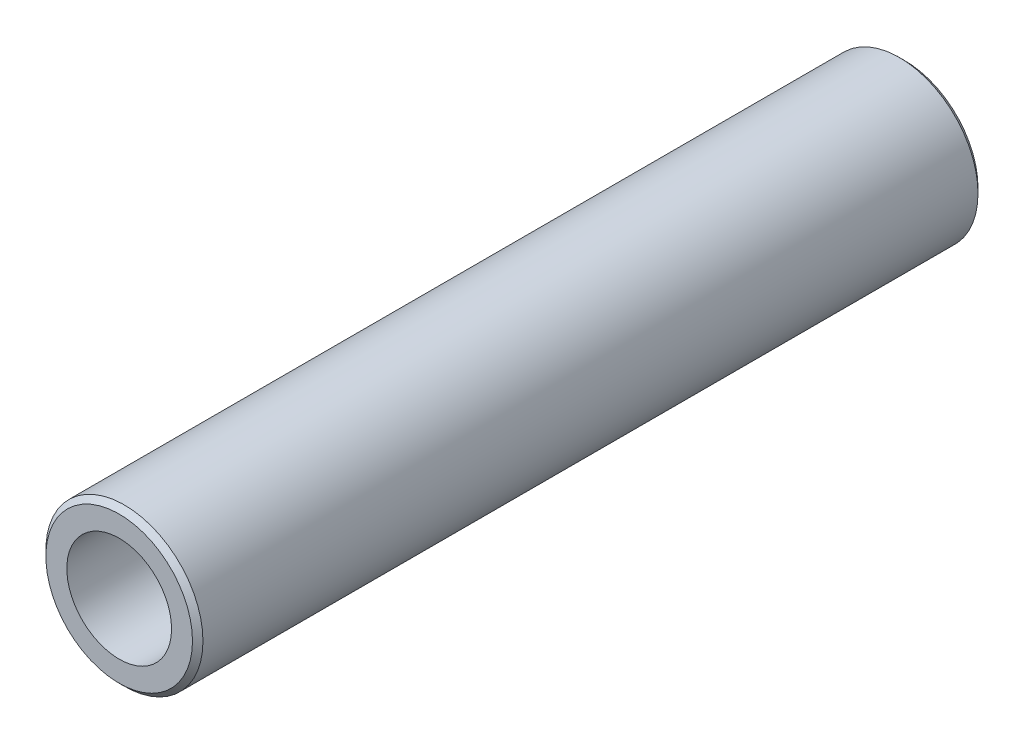
ISO-10303-21;
HEADER;
FILE_DESCRIPTION(('STEP AP214'),'2;1');
FILE_NAME('part.step','',(''),(''),'','','');
FILE_SCHEMA(('AUTOMOTIVE_DESIGN { 1 0 10303 214 1 1 1 1 }'));
ENDSEC;
DATA;
#1=APPLICATION_CONTEXT('core data for automotive mechanical design processes');
#2=APPLICATION_PROTOCOL_DEFINITION('international standard','automotive_design',2000,#1);
#3=PRODUCT_CONTEXT('',#1,'mechanical');
#4=PRODUCT('Part','Part','',(#3));
#5=PRODUCT_RELATED_PRODUCT_CATEGORY('part','',(#4));
#6=PRODUCT_DEFINITION_FORMATION('','',#4);
#7=PRODUCT_DEFINITION_CONTEXT('part definition',#1,'design');
#8=PRODUCT_DEFINITION('design','',#6,#7);
#9=PRODUCT_DEFINITION_SHAPE('','',#8);
#10=(LENGTH_UNIT() NAMED_UNIT(*) SI_UNIT(.MILLI.,.METRE.));
#11=(NAMED_UNIT(*) PLANE_ANGLE_UNIT() SI_UNIT($,.RADIAN.));
#12=(NAMED_UNIT(*) SI_UNIT($,.STERADIAN.) SOLID_ANGLE_UNIT());
#13=UNCERTAINTY_MEASURE_WITH_UNIT(LENGTH_MEASURE(1.E-05),#10,'distance_accuracy_value','');
#14=(GEOMETRIC_REPRESENTATION_CONTEXT(3) GLOBAL_UNCERTAINTY_ASSIGNED_CONTEXT((#13)) GLOBAL_UNIT_ASSIGNED_CONTEXT((#10,
#11,#12)) REPRESENTATION_CONTEXT('',''));
#15=CARTESIAN_POINT('',(0.,0.,0.));
#16=DIRECTION('',(0.,0.,1.));
#17=DIRECTION('',(1.,0.,0.));
#18=AXIS2_PLACEMENT_3D('',#15,#16,#17);
#19=CARTESIAN_POINT('',(0.,0.,0.));
#20=DIRECTION('',(0.,0.,1.));
#21=DIRECTION('',(1.,0.,0.));
#22=AXIS2_PLACEMENT_3D('',#19,#20,#21);
#23=CYLINDRICAL_SURFACE('',#22,1.);
#24=CARTESIAN_POINT('',(0.,0.,1.00000000000001));
#25=DIRECTION('',(0.,0.,1.));
#26=DIRECTION('',(1.,0.,0.));
#27=AXIS2_PLACEMENT_3D('',#24,#25,#26);
#28=CIRCLE('',#27,1.);
#29=CARTESIAN_POINT('',(1.,0.,1.00000000000001));
#30=VERTEX_POINT('',#29);
#31=EDGE_CURVE('E52',#30,#30,#28,.F.);
#32=ORIENTED_EDGE('',*,*,#31,.T.);
#33=EDGE_LOOP('',(#32));
#34=FACE_BOUND('',#33,.T.);
#35=CARTESIAN_POINT('',(0.,0.,10.));
#36=DIRECTION('',(0.,0.,1.));
#37=DIRECTION('',(1.,0.,0.));
#38=AXIS2_PLACEMENT_3D('',#35,#36,#37);
#39=CIRCLE('',#38,1.);
#40=CARTESIAN_POINT('',(1.,0.,10.));
#41=VERTEX_POINT('',#40);
#42=EDGE_CURVE('E58',#41,#41,#39,.F.);
#43=ORIENTED_EDGE('',*,*,#42,.F.);
#44=EDGE_LOOP('',(#43));
#45=FACE_BOUND('',#44,.T.);
#46=ADVANCED_FACE('F32',(#34,#45),#23,.F.);
#47=CARTESIAN_POINT('',(0.,0.,30.));
#48=DIRECTION('',(0.,0.,-1.));
#49=DIRECTION('',(-1.,0.,0.));
#50=AXIS2_PLACEMENT_3D('',#47,#48,#49);
#51=CYLINDRICAL_SURFACE('',#50,3.);
#52=CARTESIAN_POINT('',(0.,0.,29.8));
#53=DIRECTION('',(0.,0.,1.));
#54=DIRECTION('',(1.,0.,0.));
#55=AXIS2_PLACEMENT_3D('',#52,#53,#54);
#56=CIRCLE('',#55,3.);
#57=CARTESIAN_POINT('',(3.,0.,29.8));
#58=VERTEX_POINT('',#57);
#59=EDGE_CURVE('E39',#58,#58,#56,.F.);
#60=ORIENTED_EDGE('',*,*,#59,.T.);
#61=EDGE_LOOP('',(#60));
#62=FACE_BOUND('',#61,.T.);
#63=CARTESIAN_POINT('',(0.,0.,0.199999999999999));
#64=DIRECTION('',(0.,0.,1.));
#65=DIRECTION('',(1.,0.,0.));
#66=AXIS2_PLACEMENT_3D('',#63,#64,#65);
#67=CIRCLE('',#66,3.);
#68=CARTESIAN_POINT('',(3.,0.,0.199999999999999));
#69=VERTEX_POINT('',#68);
#70=EDGE_CURVE('E43',#69,#69,#67,.T.);
#71=ORIENTED_EDGE('',*,*,#70,.T.);
#72=EDGE_LOOP('',(#71));
#73=FACE_BOUND('',#72,.T.);
#74=ADVANCED_FACE('F81',(#62,#73),#51,.T.);
#75=CARTESIAN_POINT('',(0.,0.,30.));
#76=DIRECTION('',(0.,0.,1.));
#77=DIRECTION('',(1.,0.,0.));
#78=AXIS2_PLACEMENT_3D('',#75,#76,#77);
#79=PLANE('',#78);
#80=CARTESIAN_POINT('',(0.,0.,30.));
#81=DIRECTION('',(0.,0.,1.));
#82=DIRECTION('',(1.,0.,0.));
#83=AXIS2_PLACEMENT_3D('',#80,#81,#82);
#84=CIRCLE('',#83,2.8);
#85=CARTESIAN_POINT('',(2.8,0.,30.));
#86=VERTEX_POINT('',#85);
#87=EDGE_CURVE('E47',#86,#86,#84,.T.);
#88=ORIENTED_EDGE('',*,*,#87,.T.);
#89=EDGE_LOOP('',(#88));
#90=FACE_BOUND('',#89,.T.);
#91=CARTESIAN_POINT('',(0.,0.,30.));
#92=DIRECTION('',(0.,0.,1.));
#93=DIRECTION('',(1.,0.,0.));
#94=AXIS2_PLACEMENT_3D('',#91,#92,#93);
#95=CIRCLE('',#94,2.);
#96=CARTESIAN_POINT('',(2.,0.,30.));
#97=VERTEX_POINT('',#96);
#98=EDGE_CURVE('E62',#97,#97,#95,.T.);
#99=ORIENTED_EDGE('',*,*,#98,.F.);
#100=EDGE_LOOP('',(#99));
#101=FACE_BOUND('',#100,.T.);
#102=ADVANCED_FACE('F78',(#90,#101),#79,.T.);
#103=CARTESIAN_POINT('',(0.,0.,0.));
#104=DIRECTION('',(0.,0.,1.));
#105=DIRECTION('',(1.,0.,0.));
#106=AXIS2_PLACEMENT_3D('',#103,#104,#105);
#107=PLANE('',#106);
#108=CARTESIAN_POINT('',(0.,0.,0.));
#109=DIRECTION('',(0.,0.,1.));
#110=DIRECTION('',(1.,0.,0.));
#111=AXIS2_PLACEMENT_3D('',#108,#109,#110);
#112=CIRCLE('',#111,2.8);
#113=CARTESIAN_POINT('',(2.8,0.,0.));
#114=VERTEX_POINT('',#113);
#115=EDGE_CURVE('E10',#114,#114,#112,.F.);
#116=ORIENTED_EDGE('',*,*,#115,.T.);
#117=EDGE_LOOP('',(#116));
#118=FACE_BOUND('',#117,.T.);
#119=CARTESIAN_POINT('',(0.,0.,0.));
#120=DIRECTION('',(0.,0.,1.));
#121=DIRECTION('',(1.,0.,0.));
#122=AXIS2_PLACEMENT_3D('',#119,#120,#121);
#123=CIRCLE('',#122,2.);
#124=CARTESIAN_POINT('',(2.,0.,0.));
#125=VERTEX_POINT('',#124);
#126=EDGE_CURVE('E55',#125,#125,#123,.T.);
#127=ORIENTED_EDGE('',*,*,#126,.T.);
#128=EDGE_LOOP('',(#127));
#129=FACE_BOUND('',#128,.T.);
#130=ADVANCED_FACE('F80',(#118,#129),#107,.F.);
#131=CARTESIAN_POINT('',(0.,0.,10.));
#132=DIRECTION('',(0.,0.,1.));
#133=DIRECTION('',(1.,0.,0.));
#134=AXIS2_PLACEMENT_3D('',#131,#132,#133);
#135=PLANE('',#134);
#136=CARTESIAN_POINT('',(0.,0.,10.));
#137=DIRECTION('',(0.,0.,1.));
#138=DIRECTION('',(1.,0.,0.));
#139=AXIS2_PLACEMENT_3D('',#136,#137,#138);
#140=CIRCLE('',#139,2.);
#141=CARTESIAN_POINT('',(2.,0.,10.));
#142=VERTEX_POINT('',#141);
#143=EDGE_CURVE('E61',#142,#142,#140,.T.);
#144=ORIENTED_EDGE('',*,*,#143,.T.);
#145=EDGE_LOOP('',(#144));
#146=FACE_BOUND('',#145,.T.);
#147=ORIENTED_EDGE('',*,*,#42,.T.);
#148=EDGE_LOOP('',(#147));
#149=FACE_BOUND('',#148,.T.);
#150=ADVANCED_FACE('F68',(#146,#149),#135,.T.);
#151=CARTESIAN_POINT('',(0.,0.,10.));
#152=DIRECTION('',(0.,0.,1.));
#153=DIRECTION('',(1.,0.,0.));
#154=AXIS2_PLACEMENT_3D('',#151,#152,#153);
#155=CYLINDRICAL_SURFACE('',#154,2.);
#156=ORIENTED_EDGE('',*,*,#143,.F.);
#157=EDGE_LOOP('',(#156));
#158=FACE_BOUND('',#157,.T.);
#159=ORIENTED_EDGE('',*,*,#98,.T.);
#160=EDGE_LOOP('',(#159));
#161=FACE_BOUND('',#160,.T.);
#162=ADVANCED_FACE('F71',(#158,#161),#155,.F.);
#163=CARTESIAN_POINT('',(0.,0.,0.));
#164=DIRECTION('',(0.,0.,-1.));
#165=DIRECTION('',(-1.,0.,0.));
#166=AXIS2_PLACEMENT_3D('',#163,#164,#165);
#167=CONICAL_SURFACE('',#166,2.,0.785398163397447);
#168=ORIENTED_EDGE('',*,*,#31,.F.);
#169=EDGE_LOOP('',(#168));
#170=FACE_BOUND('',#169,.T.);
#171=ORIENTED_EDGE('',*,*,#126,.F.);
#172=EDGE_LOOP('',(#171));
#173=FACE_BOUND('',#172,.T.);
#174=ADVANCED_FACE('F74',(#170,#173),#167,.F.);
#175=CARTESIAN_POINT('',(0.,0.,30.));
#176=DIRECTION('',(0.,0.,-1.));
#177=DIRECTION('',(-1.,0.,0.));
#178=AXIS2_PLACEMENT_3D('',#175,#176,#177);
#179=CONICAL_SURFACE('',#178,2.8,0.785398163397453);
#180=ORIENTED_EDGE('',*,*,#59,.F.);
#181=EDGE_LOOP('',(#180));
#182=FACE_BOUND('',#181,.T.);
#183=ORIENTED_EDGE('',*,*,#87,.F.);
#184=EDGE_LOOP('',(#183));
#185=FACE_BOUND('',#184,.T.);
#186=ADVANCED_FACE('F112',(#182,#185),#179,.T.);
#187=CARTESIAN_POINT('',(0.,0.,0.199999999999999));
#188=DIRECTION('',(0.,0.,1.));
#189=DIRECTION('',(1.,0.,0.));
#190=AXIS2_PLACEMENT_3D('',#187,#188,#189);
#191=CONICAL_SURFACE('',#190,3.,0.78539816339745);
#192=ORIENTED_EDGE('',*,*,#115,.F.);
#193=EDGE_LOOP('',(#192));
#194=FACE_BOUND('',#193,.T.);
#195=ORIENTED_EDGE('',*,*,#70,.F.);
#196=EDGE_LOOP('',(#195));
#197=FACE_BOUND('',#196,.T.);
#198=ADVANCED_FACE('F34',(#194,#197),#191,.T.);
#199=CLOSED_SHELL('',(#46,#74,#102,#130,#150,#162,#174,#186,#198));
#200=MANIFOLD_SOLID_BREP('B2',#199);
#201=ADVANCED_BREP_SHAPE_REPRESENTATION('',(#18,#200),#14);
#202=SHAPE_DEFINITION_REPRESENTATION(#9,#201);
ENDSEC;
END-ISO-10303-21;
